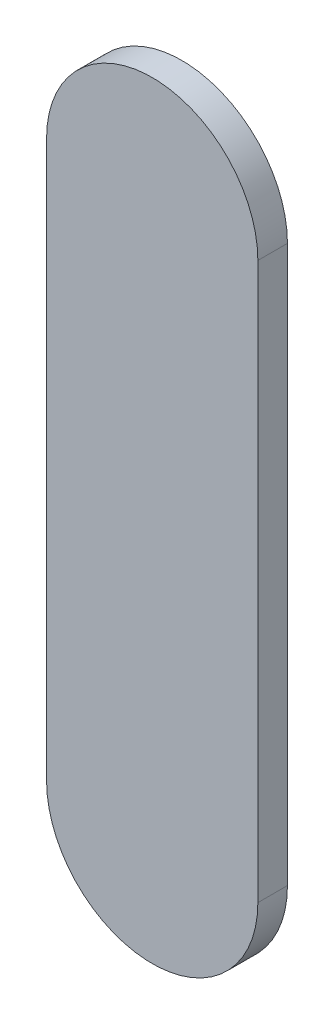
ISO-10303-21;
HEADER;
FILE_DESCRIPTION(('STEP AP214'),'2;1');
FILE_NAME('part.step','',(''),(''),'','','');
FILE_SCHEMA(('AUTOMOTIVE_DESIGN { 1 0 10303 214 1 1 1 1 }'));
ENDSEC;
DATA;
#1=APPLICATION_CONTEXT('core data for automotive mechanical design processes');
#2=APPLICATION_PROTOCOL_DEFINITION('international standard','automotive_design',2000,#1);
#3=PRODUCT_CONTEXT('',#1,'mechanical');
#4=PRODUCT('Part','Part','',(#3));
#5=PRODUCT_RELATED_PRODUCT_CATEGORY('part','',(#4));
#6=PRODUCT_DEFINITION_FORMATION('','',#4);
#7=PRODUCT_DEFINITION_CONTEXT('part definition',#1,'design');
#8=PRODUCT_DEFINITION('design','',#6,#7);
#9=PRODUCT_DEFINITION_SHAPE('','',#8);
#10=(LENGTH_UNIT() NAMED_UNIT(*) SI_UNIT(.MILLI.,.METRE.));
#11=(NAMED_UNIT(*) PLANE_ANGLE_UNIT() SI_UNIT($,.RADIAN.));
#12=(NAMED_UNIT(*) SI_UNIT($,.STERADIAN.) SOLID_ANGLE_UNIT());
#13=UNCERTAINTY_MEASURE_WITH_UNIT(LENGTH_MEASURE(1.E-05),#10,'distance_accuracy_value','');
#14=(GEOMETRIC_REPRESENTATION_CONTEXT(3) GLOBAL_UNCERTAINTY_ASSIGNED_CONTEXT((#13)) GLOBAL_UNIT_ASSIGNED_CONTEXT((#10,
#11,#12)) REPRESENTATION_CONTEXT('',''));
#15=CARTESIAN_POINT('',(0.,0.,0.));
#16=DIRECTION('',(0.,0.,1.));
#17=DIRECTION('',(1.,0.,0.));
#18=AXIS2_PLACEMENT_3D('',#15,#16,#17);
#19=CARTESIAN_POINT('',(95.98100184,87.94989776,0.));
#20=DIRECTION('',(-1.,0.,0.));
#21=DIRECTION('',(0.,1.,0.));
#22=AXIS2_PLACEMENT_3D('',#19,#20,#21);
#23=PLANE('',#22);
#24=DIRECTION('',(0.,1.,0.));
#25=VECTOR('',#24,1.);
#26=CARTESIAN_POINT('',(95.98100184,87.94989776,0.03556));
#27=LINE('',#26,#25);
#28=CARTESIAN_POINT('',(95.98100184,87.94989776,0.03556));
#29=VERTEX_POINT('',#28);
#30=CARTESIAN_POINT('',(95.98100184,88.61840544,0.03556));
#31=VERTEX_POINT('',#30);
#32=EDGE_CURVE('E11',#29,#31,#27,.T.);
#33=ORIENTED_EDGE('',*,*,#32,.F.);
#34=DIRECTION('',(0.,0.,1.));
#35=VECTOR('',#34,1.);
#36=CARTESIAN_POINT('',(95.98100184,87.94989776,0.));
#37=LINE('',#36,#35);
#38=CARTESIAN_POINT('',(95.98100184,87.94989776,0.));
#39=VERTEX_POINT('',#38);
#40=EDGE_CURVE('E24',#39,#29,#37,.T.);
#41=ORIENTED_EDGE('',*,*,#40,.F.);
#42=DIRECTION('',(0.,1.,0.));
#43=VECTOR('',#42,1.);
#44=CARTESIAN_POINT('',(95.98100184,87.94989776,0.));
#45=LINE('',#44,#43);
#46=CARTESIAN_POINT('',(95.98100184,88.61840544,0.));
#47=VERTEX_POINT('',#46);
#48=EDGE_CURVE('E75',#39,#47,#45,.T.);
#49=ORIENTED_EDGE('',*,*,#48,.T.);
#50=DIRECTION('',(0.,0.,1.));
#51=VECTOR('',#50,1.);
#52=CARTESIAN_POINT('',(95.98100184,88.61840544,0.));
#53=LINE('',#52,#51);
#54=EDGE_CURVE('E37',#47,#31,#53,.T.);
#55=ORIENTED_EDGE('',*,*,#54,.T.);
#56=EDGE_LOOP('',(#33,#41,#49,#55));
#57=FACE_BOUND('',#56,.T.);
#58=ADVANCED_FACE('F17',(#57),#23,.F.);
#59=CARTESIAN_POINT('',(95.85400184,88.61840544,0.));
#60=DIRECTION('',(0.,0.,-1.));
#61=DIRECTION('',(1.,1.11896493820492E-13,0.));
#62=AXIS2_PLACEMENT_3D('',#59,#60,#61);
#63=CYLINDRICAL_SURFACE('',#62,0.127);
#64=CARTESIAN_POINT('',(95.85400184,88.61840544,0.03556));
#65=DIRECTION('',(0.,0.,1.));
#66=DIRECTION('',(1.,1.11896493820492E-13,0.));
#67=AXIS2_PLACEMENT_3D('',#64,#65,#66);
#68=CIRCLE('',#67,0.127);
#69=CARTESIAN_POINT('',(95.72700184,88.61840544,0.03556));
#70=VERTEX_POINT('',#69);
#71=EDGE_CURVE('E83',#31,#70,#68,.T.);
#72=ORIENTED_EDGE('',*,*,#71,.F.);
#73=ORIENTED_EDGE('',*,*,#54,.F.);
#74=CARTESIAN_POINT('',(95.85400184,88.61840544,0.));
#75=DIRECTION('',(0.,0.,1.));
#76=DIRECTION('',(1.,1.11896493820492E-13,0.));
#77=AXIS2_PLACEMENT_3D('',#74,#75,#76);
#78=CIRCLE('',#77,0.127);
#79=CARTESIAN_POINT('',(95.72700184,88.61840544,0.));
#80=VERTEX_POINT('',#79);
#81=EDGE_CURVE('E81',#47,#80,#78,.T.);
#82=ORIENTED_EDGE('',*,*,#81,.T.);
#83=DIRECTION('',(0.,0.,1.));
#84=VECTOR('',#83,1.);
#85=CARTESIAN_POINT('',(95.72700184,88.61840544,0.));
#86=LINE('',#85,#84);
#87=EDGE_CURVE('E67',#80,#70,#86,.T.);
#88=ORIENTED_EDGE('',*,*,#87,.T.);
#89=EDGE_LOOP('',(#72,#73,#82,#88));
#90=FACE_BOUND('',#89,.T.);
#91=ADVANCED_FACE('F89',(#90),#63,.T.);
#92=CARTESIAN_POINT('',(95.72700184,88.61840544,0.));
#93=DIRECTION('',(1.,0.,0.));
#94=DIRECTION('',(0.,-1.,0.));
#95=AXIS2_PLACEMENT_3D('',#92,#93,#94);
#96=PLANE('',#95);
#97=DIRECTION('',(0.,-1.,0.));
#98=VECTOR('',#97,1.);
#99=CARTESIAN_POINT('',(95.72700184,88.61840544,0.03556));
#100=LINE('',#99,#98);
#101=CARTESIAN_POINT('',(95.72700184,87.94989776,0.03556));
#102=VERTEX_POINT('',#101);
#103=EDGE_CURVE('E71',#70,#102,#100,.T.);
#104=ORIENTED_EDGE('',*,*,#103,.F.);
#105=ORIENTED_EDGE('',*,*,#87,.F.);
#106=DIRECTION('',(0.,-1.,0.));
#107=VECTOR('',#106,1.);
#108=CARTESIAN_POINT('',(95.72700184,88.61840544,0.));
#109=LINE('',#108,#107);
#110=CARTESIAN_POINT('',(95.72700184,87.94989776,0.));
#111=VERTEX_POINT('',#110);
#112=EDGE_CURVE('E63',#80,#111,#109,.T.);
#113=ORIENTED_EDGE('',*,*,#112,.T.);
#114=DIRECTION('',(0.,0.,1.));
#115=VECTOR('',#114,1.);
#116=CARTESIAN_POINT('',(95.72700184,87.94989776,0.));
#117=LINE('',#116,#115);
#118=EDGE_CURVE('E53',#111,#102,#117,.T.);
#119=ORIENTED_EDGE('',*,*,#118,.T.);
#120=EDGE_LOOP('',(#104,#105,#113,#119));
#121=FACE_BOUND('',#120,.T.);
#122=ADVANCED_FACE('F66',(#121),#96,.F.);
#123=CARTESIAN_POINT('',(95.85400184,87.94989776,0.));
#124=DIRECTION('',(0.,0.,-1.));
#125=DIRECTION('',(-1.,0.,0.));
#126=AXIS2_PLACEMENT_3D('',#123,#124,#125);
#127=CYLINDRICAL_SURFACE('',#126,0.126999999999995);
#128=CARTESIAN_POINT('',(95.85400184,87.94989776,0.03556));
#129=DIRECTION('',(0.,0.,1.));
#130=DIRECTION('',(-1.,0.,0.));
#131=AXIS2_PLACEMENT_3D('',#128,#129,#130);
#132=CIRCLE('',#131,0.126999999999995);
#133=EDGE_CURVE('E59',#102,#29,#132,.T.);
#134=ORIENTED_EDGE('',*,*,#133,.F.);
#135=ORIENTED_EDGE('',*,*,#118,.F.);
#136=CARTESIAN_POINT('',(95.85400184,87.94989776,0.));
#137=DIRECTION('',(0.,0.,1.));
#138=DIRECTION('',(-1.,0.,0.));
#139=AXIS2_PLACEMENT_3D('',#136,#137,#138);
#140=CIRCLE('',#139,0.126999999999995);
#141=EDGE_CURVE('E57',#111,#39,#140,.T.);
#142=ORIENTED_EDGE('',*,*,#141,.T.);
#143=ORIENTED_EDGE('',*,*,#40,.T.);
#144=EDGE_LOOP('',(#134,#135,#142,#143));
#145=FACE_BOUND('',#144,.T.);
#146=ADVANCED_FACE('F55',(#145),#127,.T.);
#147=CARTESIAN_POINT('',(95.98100184,87.94989776,0.));
#148=DIRECTION('',(0.,0.,-1.));
#149=DIRECTION('',(-1.,0.,0.));
#150=AXIS2_PLACEMENT_3D('',#147,#148,#149);
#151=PLANE('',#150);
#152=ORIENTED_EDGE('',*,*,#141,.F.);
#153=ORIENTED_EDGE('',*,*,#112,.F.);
#154=ORIENTED_EDGE('',*,*,#81,.F.);
#155=ORIENTED_EDGE('',*,*,#48,.F.);
#156=EDGE_LOOP('',(#152,#153,#154,#155));
#157=FACE_BOUND('',#156,.T.);
#158=ADVANCED_FACE('F74',(#157),#151,.T.);
#159=CARTESIAN_POINT('',(95.98100184,87.94989776,0.03556));
#160=DIRECTION('',(0.,0.,-1.));
#161=DIRECTION('',(-1.,0.,0.));
#162=AXIS2_PLACEMENT_3D('',#159,#160,#161);
#163=PLANE('',#162);
#164=ORIENTED_EDGE('',*,*,#32,.T.);
#165=ORIENTED_EDGE('',*,*,#71,.T.);
#166=ORIENTED_EDGE('',*,*,#103,.T.);
#167=ORIENTED_EDGE('',*,*,#133,.T.);
#168=EDGE_LOOP('',(#164,#165,#166,#167));
#169=FACE_BOUND('',#168,.T.);
#170=ADVANCED_FACE('F91',(#169),#163,.F.);
#171=CLOSED_SHELL('',(#58,#91,#122,#146,#158,#170));
#172=MANIFOLD_SOLID_BREP('B1',#171);
#173=ADVANCED_BREP_SHAPE_REPRESENTATION('',(#18,#172),#14);
#174=SHAPE_DEFINITION_REPRESENTATION(#9,#173);
ENDSEC;
END-ISO-10303-21;
